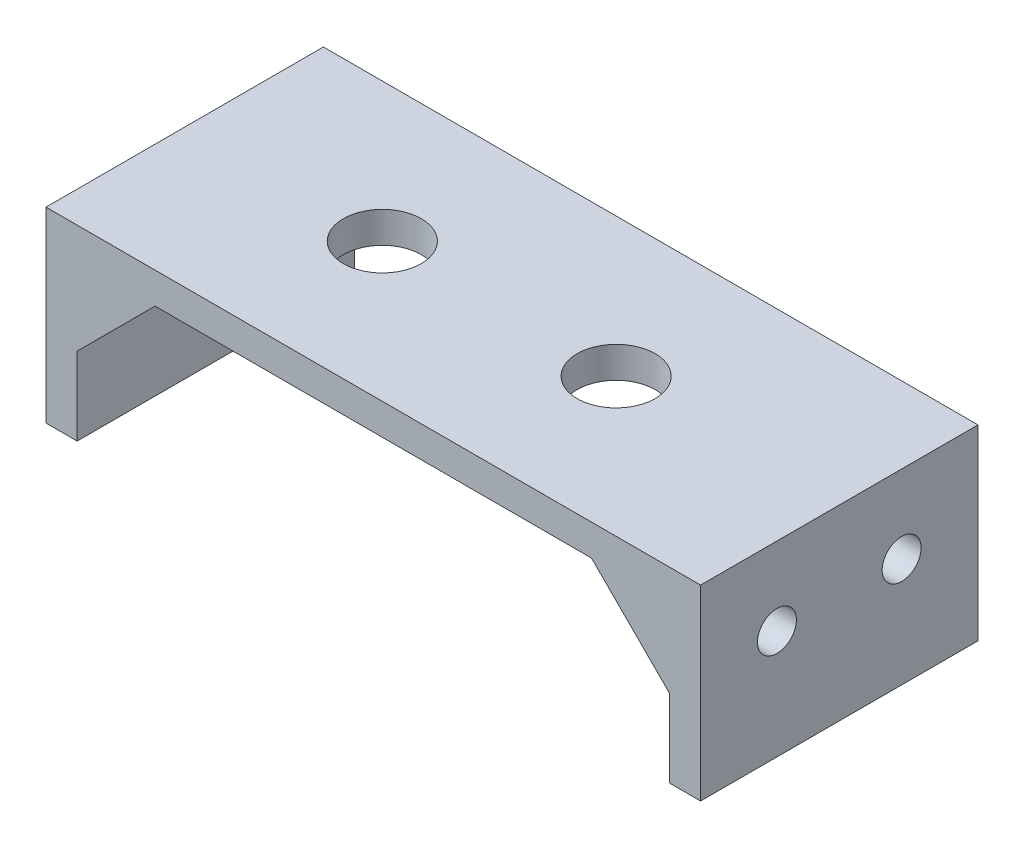
ISO-10303-21;
HEADER;
FILE_DESCRIPTION(('STEP AP214'),'2;1');
FILE_NAME('part.step','',(''),(''),'','','');
FILE_SCHEMA(('AUTOMOTIVE_DESIGN { 1 0 10303 214 1 1 1 1 }'));
ENDSEC;
DATA;
#1=APPLICATION_CONTEXT('core data for automotive mechanical design processes');
#2=APPLICATION_PROTOCOL_DEFINITION('international standard','automotive_design',2000,#1);
#3=PRODUCT_CONTEXT('',#1,'mechanical');
#4=PRODUCT('Part','Part','',(#3));
#5=PRODUCT_RELATED_PRODUCT_CATEGORY('part','',(#4));
#6=PRODUCT_DEFINITION_FORMATION('','',#4);
#7=PRODUCT_DEFINITION_CONTEXT('part definition',#1,'design');
#8=PRODUCT_DEFINITION('design','',#6,#7);
#9=PRODUCT_DEFINITION_SHAPE('','',#8);
#10=(LENGTH_UNIT() NAMED_UNIT(*) SI_UNIT(.MILLI.,.METRE.));
#11=(NAMED_UNIT(*) PLANE_ANGLE_UNIT() SI_UNIT($,.RADIAN.));
#12=(NAMED_UNIT(*) SI_UNIT($,.STERADIAN.) SOLID_ANGLE_UNIT());
#13=UNCERTAINTY_MEASURE_WITH_UNIT(LENGTH_MEASURE(1.E-05),#10,'distance_accuracy_value','');
#14=(GEOMETRIC_REPRESENTATION_CONTEXT(3) GLOBAL_UNCERTAINTY_ASSIGNED_CONTEXT((#13)) GLOBAL_UNIT_ASSIGNED_CONTEXT((#10,
#11,#12)) REPRESENTATION_CONTEXT('',''));
#15=CARTESIAN_POINT('',(0.,0.,0.));
#16=DIRECTION('',(0.,0.,1.));
#17=DIRECTION('',(1.,0.,0.));
#18=AXIS2_PLACEMENT_3D('',#15,#16,#17);
#19=CARTESIAN_POINT('',(0.,0.,0.));
#20=DIRECTION('',(0.,1.,0.));
#21=DIRECTION('',(0.,0.,1.));
#22=AXIS2_PLACEMENT_3D('',#19,#20,#21);
#23=PLANE('',#22);
#24=CARTESIAN_POINT('',(-8.31990662492034,0.,0.));
#25=DIRECTION('',(0.,-1.,0.));
#26=DIRECTION('',(0.,0.,-1.));
#27=AXIS2_PLACEMENT_3D('',#24,#25,#26);
#28=CIRCLE('',#27,2.5);
#29=CARTESIAN_POINT('',(-8.31990662492034,0.,-2.5));
#30=VERTEX_POINT('',#29);
#31=EDGE_CURVE('E454',#30,#30,#28,.T.);
#32=ORIENTED_EDGE('',*,*,#31,.F.);
#33=EDGE_LOOP('',(#32));
#34=FACE_BOUND('',#33,.T.);
#35=CARTESIAN_POINT('',(6.68009337507966,0.,0.));
#36=DIRECTION('',(0.,-1.,0.));
#37=DIRECTION('',(0.,0.,-1.));
#38=AXIS2_PLACEMENT_3D('',#35,#36,#37);
#39=CIRCLE('',#38,2.5);
#40=CARTESIAN_POINT('',(6.68009337507966,0.,-2.5));
#41=VERTEX_POINT('',#40);
#42=EDGE_CURVE('E185',#41,#41,#39,.T.);
#43=ORIENTED_EDGE('',*,*,#42,.F.);
#44=EDGE_LOOP('',(#43));
#45=FACE_BOUND('',#44,.T.);
#46=DIRECTION('',(0.,0.,-1.));
#47=VECTOR('',#46,1.);
#48=CARTESIAN_POINT('',(14.,0.,-6.9));
#49=LINE('',#48,#47);
#50=CARTESIAN_POINT('',(14.,0.,-6.9));
#51=VERTEX_POINT('',#50);
#52=CARTESIAN_POINT('',(14.,0.,-8.9));
#53=VERTEX_POINT('',#52);
#54=EDGE_CURVE('E173',#51,#53,#49,.T.);
#55=ORIENTED_EDGE('',*,*,#54,.F.);
#56=DIRECTION('',(-1.,0.,0.));
#57=VECTOR('',#56,1.);
#58=CARTESIAN_POINT('',(19.,0.,-6.9));
#59=LINE('',#58,#57);
#60=CARTESIAN_POINT('',(19.,0.,-6.9));
#61=VERTEX_POINT('',#60);
#62=EDGE_CURVE('E160',#61,#51,#59,.T.);
#63=ORIENTED_EDGE('',*,*,#62,.F.);
#64=DIRECTION('',(0.,0.,-1.));
#65=VECTOR('',#64,1.);
#66=CARTESIAN_POINT('',(19.,0.,8.90000000000001));
#67=LINE('',#66,#65);
#68=CARTESIAN_POINT('',(19.,0.,6.9));
#69=VERTEX_POINT('',#68);
#70=EDGE_CURVE('E178',#69,#61,#67,.T.);
#71=ORIENTED_EDGE('',*,*,#70,.F.);
#72=DIRECTION('',(-1.,0.,0.));
#73=VECTOR('',#72,1.);
#74=CARTESIAN_POINT('',(19.,0.,6.9));
#75=LINE('',#74,#73);
#76=CARTESIAN_POINT('',(14.,0.,6.9));
#77=VERTEX_POINT('',#76);
#78=EDGE_CURVE('E216',#69,#77,#75,.T.);
#79=ORIENTED_EDGE('',*,*,#78,.T.);
#80=DIRECTION('',(0.,0.,1.));
#81=VECTOR('',#80,1.);
#82=CARTESIAN_POINT('',(14.,0.,6.9));
#83=LINE('',#82,#81);
#84=CARTESIAN_POINT('',(14.,0.,8.9));
#85=VERTEX_POINT('',#84);
#86=EDGE_CURVE('E223',#77,#85,#83,.T.);
#87=ORIENTED_EDGE('',*,*,#86,.T.);
#88=DIRECTION('',(1.,0.,0.));
#89=VECTOR('',#88,1.);
#90=CARTESIAN_POINT('',(-21.,0.,8.9));
#91=LINE('',#90,#89);
#92=CARTESIAN_POINT('',(-14.,0.,8.9));
#93=VERTEX_POINT('',#92);
#94=EDGE_CURVE('E306',#93,#85,#91,.T.);
#95=ORIENTED_EDGE('',*,*,#94,.F.);
#96=DIRECTION('',(0.,0.,1.));
#97=VECTOR('',#96,1.);
#98=CARTESIAN_POINT('',(-14.,0.,6.9));
#99=LINE('',#98,#97);
#100=CARTESIAN_POINT('',(-14.,0.,6.9));
#101=VERTEX_POINT('',#100);
#102=EDGE_CURVE('E249',#101,#93,#99,.T.);
#103=ORIENTED_EDGE('',*,*,#102,.F.);
#104=DIRECTION('',(-1.,0.,0.));
#105=VECTOR('',#104,1.);
#106=CARTESIAN_POINT('',(-19.,0.,6.9));
#107=LINE('',#106,#105);
#108=CARTESIAN_POINT('',(-19.,0.,6.9));
#109=VERTEX_POINT('',#108);
#110=EDGE_CURVE('E241',#101,#109,#107,.T.);
#111=ORIENTED_EDGE('',*,*,#110,.T.);
#112=DIRECTION('',(0.,0.,1.));
#113=VECTOR('',#112,1.);
#114=CARTESIAN_POINT('',(-19.,0.,8.9));
#115=LINE('',#114,#113);
#116=CARTESIAN_POINT('',(-19.,0.,-6.9));
#117=VERTEX_POINT('',#116);
#118=EDGE_CURVE('E277',#117,#109,#115,.T.);
#119=ORIENTED_EDGE('',*,*,#118,.F.);
#120=DIRECTION('',(-1.,0.,0.));
#121=VECTOR('',#120,1.);
#122=CARTESIAN_POINT('',(-19.,0.,-6.9));
#123=LINE('',#122,#121);
#124=CARTESIAN_POINT('',(-14.,0.,-6.9));
#125=VERTEX_POINT('',#124);
#126=EDGE_CURVE('E55',#125,#117,#123,.T.);
#127=ORIENTED_EDGE('',*,*,#126,.F.);
#128=DIRECTION('',(0.,0.,-1.));
#129=VECTOR('',#128,1.);
#130=CARTESIAN_POINT('',(-14.,0.,-6.9));
#131=LINE('',#130,#129);
#132=CARTESIAN_POINT('',(-14.,0.,-8.9));
#133=VERTEX_POINT('',#132);
#134=EDGE_CURVE('E202',#125,#133,#131,.T.);
#135=ORIENTED_EDGE('',*,*,#134,.T.);
#136=DIRECTION('',(-1.,0.,0.));
#137=VECTOR('',#136,1.);
#138=CARTESIAN_POINT('',(-21.,0.,-8.9));
#139=LINE('',#138,#137);
#140=EDGE_CURVE('E63',#53,#133,#139,.T.);
#141=ORIENTED_EDGE('',*,*,#140,.F.);
#142=EDGE_LOOP('',(#55,#63,#71,#79,#87,#95,#103,#111,#119,#127,#135,#141));
#143=FACE_BOUND('',#142,.T.);
#144=ADVANCED_FACE('F39',(#34,#45,#143),#23,.F.);
#145=CARTESIAN_POINT('',(19.,-10.,8.90000000000001));
#146=DIRECTION('',(1.,0.,0.));
#147=DIRECTION('',(0.,0.,-1.));
#148=AXIS2_PLACEMENT_3D('',#145,#146,#147);
#149=PLANE('',#148);
#150=CARTESIAN_POINT('',(19.,-3.,4.));
#151=DIRECTION('',(1.,0.,0.));
#152=DIRECTION('',(0.,0.,-1.));
#153=AXIS2_PLACEMENT_3D('',#150,#151,#152);
#154=CIRCLE('',#153,1.25);
#155=CARTESIAN_POINT('',(19.,-3.,2.75));
#156=VERTEX_POINT('',#155);
#157=EDGE_CURVE('E424',#156,#156,#154,.T.);
#158=ORIENTED_EDGE('',*,*,#157,.T.);
#159=EDGE_LOOP('',(#158));
#160=FACE_BOUND('',#159,.T.);
#161=CARTESIAN_POINT('',(19.,-3.,-4.));
#162=DIRECTION('',(1.,0.,0.));
#163=DIRECTION('',(0.,0.,-1.));
#164=AXIS2_PLACEMENT_3D('',#161,#162,#163);
#165=CIRCLE('',#164,1.25);
#166=CARTESIAN_POINT('',(19.,-3.,-5.25));
#167=VERTEX_POINT('',#166);
#168=EDGE_CURVE('E425',#167,#167,#165,.T.);
#169=ORIENTED_EDGE('',*,*,#168,.T.);
#170=EDGE_LOOP('',(#169));
#171=FACE_BOUND('',#170,.T.);
#172=DIRECTION('',(0.,0.,-1.));
#173=VECTOR('',#172,1.);
#174=CARTESIAN_POINT('',(19.,-5.00000000000007,-6.9));
#175=LINE('',#174,#173);
#176=CARTESIAN_POINT('',(19.,-5.00000000000007,-6.9));
#177=VERTEX_POINT('',#176);
#178=CARTESIAN_POINT('',(19.,-5.00000000000007,-8.9));
#179=VERTEX_POINT('',#178);
#180=EDGE_CURVE('E166',#177,#179,#175,.T.);
#181=ORIENTED_EDGE('',*,*,#180,.T.);
#182=DIRECTION('',(0.,1.,0.));
#183=VECTOR('',#182,1.);
#184=CARTESIAN_POINT('',(19.,-10.,-8.9));
#185=LINE('',#184,#183);
#186=CARTESIAN_POINT('',(19.,-10.,-8.9));
#187=VERTEX_POINT('',#186);
#188=EDGE_CURVE('E269',#187,#179,#185,.T.);
#189=ORIENTED_EDGE('',*,*,#188,.F.);
#190=DIRECTION('',(0.,0.,-1.));
#191=VECTOR('',#190,1.);
#192=CARTESIAN_POINT('',(19.,-10.,8.90000000000001));
#193=LINE('',#192,#191);
#194=CARTESIAN_POINT('',(19.,-10.,8.90000000000001));
#195=VERTEX_POINT('',#194);
#196=EDGE_CURVE('E262',#195,#187,#193,.T.);
#197=ORIENTED_EDGE('',*,*,#196,.F.);
#198=DIRECTION('',(0.,1.,0.));
#199=VECTOR('',#198,1.);
#200=CARTESIAN_POINT('',(19.,-10.,8.90000000000001));
#201=LINE('',#200,#199);
#202=CARTESIAN_POINT('',(19.,-5.00000000000007,8.90000000000001));
#203=VERTEX_POINT('',#202);
#204=EDGE_CURVE('E274',#195,#203,#201,.T.);
#205=ORIENTED_EDGE('',*,*,#204,.T.);
#206=DIRECTION('',(0.,0.,1.));
#207=VECTOR('',#206,1.);
#208=CARTESIAN_POINT('',(19.,-5.00000000000007,6.9));
#209=LINE('',#208,#207);
#210=CARTESIAN_POINT('',(19.,-5.00000000000007,6.9));
#211=VERTEX_POINT('',#210);
#212=EDGE_CURVE('E227',#211,#203,#209,.T.);
#213=ORIENTED_EDGE('',*,*,#212,.F.);
#214=DIRECTION('',(0.,1.,0.));
#215=VECTOR('',#214,1.);
#216=CARTESIAN_POINT('',(19.,-5.00000000000007,6.9));
#217=LINE('',#216,#215);
#218=EDGE_CURVE('E213',#211,#69,#217,.T.);
#219=ORIENTED_EDGE('',*,*,#218,.T.);
#220=ORIENTED_EDGE('',*,*,#70,.T.);
#221=DIRECTION('',(0.,1.,0.));
#222=VECTOR('',#221,1.);
#223=CARTESIAN_POINT('',(19.,-5.00000000000007,-6.9));
#224=LINE('',#223,#222);
#225=EDGE_CURVE('E158',#177,#61,#224,.T.);
#226=ORIENTED_EDGE('',*,*,#225,.F.);
#227=EDGE_LOOP('',(#181,#189,#197,#205,#213,#219,#220,#226));
#228=FACE_BOUND('',#227,.T.);
#229=ADVANCED_FACE('F176',(#160,#171,#228),#149,.F.);
#230=CARTESIAN_POINT('',(-19.,-10.,8.9));
#231=DIRECTION('',(-1.,0.,0.));
#232=DIRECTION('',(0.,0.,1.));
#233=AXIS2_PLACEMENT_3D('',#230,#231,#232);
#234=PLANE('',#233);
#235=CARTESIAN_POINT('',(-19.,-3.,4.));
#236=DIRECTION('',(1.,0.,0.));
#237=DIRECTION('',(0.,0.,-1.));
#238=AXIS2_PLACEMENT_3D('',#235,#236,#237);
#239=CIRCLE('',#238,1.25);
#240=CARTESIAN_POINT('',(-19.,-3.,2.75));
#241=VERTEX_POINT('',#240);
#242=EDGE_CURVE('E439',#241,#241,#239,.T.);
#243=ORIENTED_EDGE('',*,*,#242,.F.);
#244=EDGE_LOOP('',(#243));
#245=FACE_BOUND('',#244,.T.);
#246=CARTESIAN_POINT('',(-19.,-3.,-4.));
#247=DIRECTION('',(1.,0.,0.));
#248=DIRECTION('',(0.,0.,-1.));
#249=AXIS2_PLACEMENT_3D('',#246,#247,#248);
#250=CIRCLE('',#249,1.25);
#251=CARTESIAN_POINT('',(-19.,-3.,-5.25));
#252=VERTEX_POINT('',#251);
#253=EDGE_CURVE('E447',#252,#252,#250,.T.);
#254=ORIENTED_EDGE('',*,*,#253,.F.);
#255=EDGE_LOOP('',(#254));
#256=FACE_BOUND('',#255,.T.);
#257=DIRECTION('',(0.,0.,-1.));
#258=VECTOR('',#257,1.);
#259=CARTESIAN_POINT('',(-19.,-5.,-6.9));
#260=LINE('',#259,#258);
#261=CARTESIAN_POINT('',(-19.,-5.,-6.9));
#262=VERTEX_POINT('',#261);
#263=CARTESIAN_POINT('',(-19.,-5.,-8.9));
#264=VERTEX_POINT('',#263);
#265=EDGE_CURVE('E206',#262,#264,#260,.T.);
#266=ORIENTED_EDGE('',*,*,#265,.F.);
#267=DIRECTION('',(0.,-1.,0.));
#268=VECTOR('',#267,1.);
#269=CARTESIAN_POINT('',(-19.,-5.,-6.9));
#270=LINE('',#269,#268);
#271=EDGE_CURVE('E193',#117,#262,#270,.T.);
#272=ORIENTED_EDGE('',*,*,#271,.F.);
#273=ORIENTED_EDGE('',*,*,#118,.T.);
#274=DIRECTION('',(0.,-1.,0.));
#275=VECTOR('',#274,1.);
#276=CARTESIAN_POINT('',(-19.,-5.,6.9));
#277=LINE('',#276,#275);
#278=CARTESIAN_POINT('',(-19.,-5.,6.9));
#279=VERTEX_POINT('',#278);
#280=EDGE_CURVE('E234',#109,#279,#277,.T.);
#281=ORIENTED_EDGE('',*,*,#280,.T.);
#282=DIRECTION('',(0.,0.,1.));
#283=VECTOR('',#282,1.);
#284=CARTESIAN_POINT('',(-19.,-5.,6.9));
#285=LINE('',#284,#283);
#286=CARTESIAN_POINT('',(-19.,-5.,8.9));
#287=VERTEX_POINT('',#286);
#288=EDGE_CURVE('E245',#279,#287,#285,.T.);
#289=ORIENTED_EDGE('',*,*,#288,.T.);
#290=DIRECTION('',(0.,1.,0.));
#291=VECTOR('',#290,1.);
#292=CARTESIAN_POINT('',(-19.,-10.,8.9));
#293=LINE('',#292,#291);
#294=CARTESIAN_POINT('',(-19.,-10.,8.9));
#295=VERTEX_POINT('',#294);
#296=EDGE_CURVE('E292',#295,#287,#293,.T.);
#297=ORIENTED_EDGE('',*,*,#296,.F.);
#298=DIRECTION('',(0.,0.,1.));
#299=VECTOR('',#298,1.);
#300=CARTESIAN_POINT('',(-19.,-10.,8.9));
#301=LINE('',#300,#299);
#302=CARTESIAN_POINT('',(-19.,-10.,-8.9));
#303=VERTEX_POINT('',#302);
#304=EDGE_CURVE('E285',#303,#295,#301,.T.);
#305=ORIENTED_EDGE('',*,*,#304,.F.);
#306=DIRECTION('',(0.,1.,0.));
#307=VECTOR('',#306,1.);
#308=CARTESIAN_POINT('',(-19.,-10.,-8.9));
#309=LINE('',#308,#307);
#310=EDGE_CURVE('E298',#303,#264,#309,.T.);
#311=ORIENTED_EDGE('',*,*,#310,.T.);
#312=EDGE_LOOP('',(#266,#272,#273,#281,#289,#297,#305,#311));
#313=FACE_BOUND('',#312,.T.);
#314=ADVANCED_FACE('F362',(#245,#256,#313),#234,.F.);
#315=CARTESIAN_POINT('',(21.,2.,-8.9));
#316=DIRECTION('',(-1.,0.,0.));
#317=DIRECTION('',(0.,0.,1.));
#318=AXIS2_PLACEMENT_3D('',#315,#316,#317);
#319=PLANE('',#318);
#320=CARTESIAN_POINT('',(21.,-3.,4.));
#321=DIRECTION('',(1.,0.,0.));
#322=DIRECTION('',(0.,0.,-1.));
#323=AXIS2_PLACEMENT_3D('',#320,#321,#322);
#324=CIRCLE('',#323,1.25);
#325=CARTESIAN_POINT('',(21.,-3.,2.75));
#326=VERTEX_POINT('',#325);
#327=EDGE_CURVE('E418',#326,#326,#324,.T.);
#328=ORIENTED_EDGE('',*,*,#327,.F.);
#329=EDGE_LOOP('',(#328));
#330=FACE_BOUND('',#329,.T.);
#331=CARTESIAN_POINT('',(21.,-3.,-4.));
#332=DIRECTION('',(1.,0.,0.));
#333=DIRECTION('',(0.,0.,-1.));
#334=AXIS2_PLACEMENT_3D('',#331,#332,#333);
#335=CIRCLE('',#334,1.25);
#336=CARTESIAN_POINT('',(21.,-3.,-5.25));
#337=VERTEX_POINT('',#336);
#338=EDGE_CURVE('E421',#337,#337,#335,.T.);
#339=ORIENTED_EDGE('',*,*,#338,.F.);
#340=EDGE_LOOP('',(#339));
#341=FACE_BOUND('',#340,.T.);
#342=DIRECTION('',(0.,-1.,0.));
#343=VECTOR('',#342,1.);
#344=CARTESIAN_POINT('',(21.,2.,8.9));
#345=LINE('',#344,#343);
#346=CARTESIAN_POINT('',(21.,2.,8.9));
#347=VERTEX_POINT('',#346);
#348=CARTESIAN_POINT('',(21.,-10.,8.9));
#349=VERTEX_POINT('',#348);
#350=EDGE_CURVE('E315',#347,#349,#345,.T.);
#351=ORIENTED_EDGE('',*,*,#350,.T.);
#352=DIRECTION('',(0.,0.,1.));
#353=VECTOR('',#352,1.);
#354=CARTESIAN_POINT('',(21.,-10.,8.9));
#355=LINE('',#354,#353);
#356=CARTESIAN_POINT('',(21.,-10.,-8.9));
#357=VERTEX_POINT('',#356);
#358=EDGE_CURVE('E255',#357,#349,#355,.T.);
#359=ORIENTED_EDGE('',*,*,#358,.F.);
#360=DIRECTION('',(0.,-1.,0.));
#361=VECTOR('',#360,1.);
#362=CARTESIAN_POINT('',(21.,2.,-8.9));
#363=LINE('',#362,#361);
#364=CARTESIAN_POINT('',(21.,2.,-8.9));
#365=VERTEX_POINT('',#364);
#366=EDGE_CURVE('E11',#365,#357,#363,.T.);
#367=ORIENTED_EDGE('',*,*,#366,.F.);
#368=DIRECTION('',(0.,0.,-1.));
#369=VECTOR('',#368,1.);
#370=CARTESIAN_POINT('',(21.,2.,-8.9));
#371=LINE('',#370,#369);
#372=EDGE_CURVE('E301',#347,#365,#371,.T.);
#373=ORIENTED_EDGE('',*,*,#372,.F.);
#374=EDGE_LOOP('',(#351,#359,#367,#373));
#375=FACE_BOUND('',#374,.T.);
#376=ADVANCED_FACE('F41',(#330,#341,#375),#319,.F.);
#377=CARTESIAN_POINT('',(-21.,2.,-8.9));
#378=DIRECTION('',(0.,0.,1.));
#379=DIRECTION('',(1.,0.,0.));
#380=AXIS2_PLACEMENT_3D('',#377,#378,#379);
#381=PLANE('',#380);
#382=DIRECTION('',(0.707106781186545,-0.70710678118655,0.));
#383=VECTOR('',#382,1.);
#384=CARTESIAN_POINT('',(19.,-5.00000000000007,-8.9));
#385=LINE('',#384,#383);
#386=EDGE_CURVE('E168',#53,#179,#385,.T.);
#387=ORIENTED_EDGE('',*,*,#386,.F.);
#388=ORIENTED_EDGE('',*,*,#140,.T.);
#389=DIRECTION('',(0.707106781186548,0.707106781186547,0.));
#390=VECTOR('',#389,1.);
#391=CARTESIAN_POINT('',(-19.,-5.,-8.9));
#392=LINE('',#391,#390);
#393=EDGE_CURVE('E191',#264,#133,#392,.T.);
#394=ORIENTED_EDGE('',*,*,#393,.F.);
#395=ORIENTED_EDGE('',*,*,#310,.F.);
#396=DIRECTION('',(1.,0.,0.));
#397=VECTOR('',#396,1.);
#398=CARTESIAN_POINT('',(-21.,-10.,-8.9));
#399=LINE('',#398,#397);
#400=CARTESIAN_POINT('',(-21.,-10.,-8.9));
#401=VERTEX_POINT('',#400);
#402=EDGE_CURVE('E282',#401,#303,#399,.T.);
#403=ORIENTED_EDGE('',*,*,#402,.F.);
#404=DIRECTION('',(0.,-1.,0.));
#405=VECTOR('',#404,1.);
#406=CARTESIAN_POINT('',(-21.,2.,-8.9));
#407=LINE('',#406,#405);
#408=CARTESIAN_POINT('',(-21.,2.,-8.9));
#409=VERTEX_POINT('',#408);
#410=EDGE_CURVE('E48',#409,#401,#407,.T.);
#411=ORIENTED_EDGE('',*,*,#410,.F.);
#412=DIRECTION('',(-1.,0.,0.));
#413=VECTOR('',#412,1.);
#414=CARTESIAN_POINT('',(-21.,2.,-8.9));
#415=LINE('',#414,#413);
#416=EDGE_CURVE('E305',#365,#409,#415,.T.);
#417=ORIENTED_EDGE('',*,*,#416,.F.);
#418=ORIENTED_EDGE('',*,*,#366,.T.);
#419=DIRECTION('',(1.,0.,0.));
#420=VECTOR('',#419,1.);
#421=CARTESIAN_POINT('',(21.,-10.,-8.9));
#422=LINE('',#421,#420);
#423=EDGE_CURVE('E265',#187,#357,#422,.T.);
#424=ORIENTED_EDGE('',*,*,#423,.F.);
#425=ORIENTED_EDGE('',*,*,#188,.T.);
#426=EDGE_LOOP('',(#387,#388,#394,#395,#403,#411,#417,#418,#424,#425));
#427=FACE_BOUND('',#426,.T.);
#428=ADVANCED_FACE('F334',(#427),#381,.F.);
#429=CARTESIAN_POINT('',(-21.,2.,-8.9));
#430=DIRECTION('',(1.,0.,0.));
#431=DIRECTION('',(0.,0.,-1.));
#432=AXIS2_PLACEMENT_3D('',#429,#430,#431);
#433=PLANE('',#432);
#434=CARTESIAN_POINT('',(-21.,-3.,4.));
#435=DIRECTION('',(1.,0.,0.));
#436=DIRECTION('',(0.,0.,-1.));
#437=AXIS2_PLACEMENT_3D('',#434,#435,#436);
#438=CIRCLE('',#437,1.25);
#439=CARTESIAN_POINT('',(-21.,-3.,2.75));
#440=VERTEX_POINT('',#439);
#441=EDGE_CURVE('E435',#440,#440,#438,.T.);
#442=ORIENTED_EDGE('',*,*,#441,.T.);
#443=EDGE_LOOP('',(#442));
#444=FACE_BOUND('',#443,.T.);
#445=CARTESIAN_POINT('',(-21.,-3.,-4.));
#446=DIRECTION('',(1.,0.,0.));
#447=DIRECTION('',(0.,0.,-1.));
#448=AXIS2_PLACEMENT_3D('',#445,#446,#447);
#449=CIRCLE('',#448,1.25);
#450=CARTESIAN_POINT('',(-21.,-3.,-5.25));
#451=VERTEX_POINT('',#450);
#452=EDGE_CURVE('E443',#451,#451,#449,.T.);
#453=ORIENTED_EDGE('',*,*,#452,.T.);
#454=EDGE_LOOP('',(#453));
#455=FACE_BOUND('',#454,.T.);
#456=ORIENTED_EDGE('',*,*,#410,.T.);
#457=DIRECTION('',(0.,0.,-1.));
#458=VECTOR('',#457,1.);
#459=CARTESIAN_POINT('',(-21.,-10.,8.9));
#460=LINE('',#459,#458);
#461=CARTESIAN_POINT('',(-21.,-10.,8.9));
#462=VERTEX_POINT('',#461);
#463=EDGE_CURVE('E278',#462,#401,#460,.T.);
#464=ORIENTED_EDGE('',*,*,#463,.F.);
#465=DIRECTION('',(0.,-1.,0.));
#466=VECTOR('',#465,1.);
#467=CARTESIAN_POINT('',(-21.,2.,8.9));
#468=LINE('',#467,#466);
#469=CARTESIAN_POINT('',(-21.,2.,8.9));
#470=VERTEX_POINT('',#469);
#471=EDGE_CURVE('E323',#470,#462,#468,.T.);
#472=ORIENTED_EDGE('',*,*,#471,.F.);
#473=DIRECTION('',(0.,0.,1.));
#474=VECTOR('',#473,1.);
#475=CARTESIAN_POINT('',(-21.,2.,-8.9));
#476=LINE('',#475,#474);
#477=EDGE_CURVE('E309',#409,#470,#476,.T.);
#478=ORIENTED_EDGE('',*,*,#477,.F.);
#479=EDGE_LOOP('',(#456,#464,#472,#478));
#480=FACE_BOUND('',#479,.T.);
#481=ADVANCED_FACE('F331',(#444,#455,#480),#433,.F.);
#482=CARTESIAN_POINT('',(-21.,2.,8.9));
#483=DIRECTION('',(0.,0.,-1.));
#484=DIRECTION('',(-1.,0.,0.));
#485=AXIS2_PLACEMENT_3D('',#482,#483,#484);
#486=PLANE('',#485);
#487=ORIENTED_EDGE('',*,*,#94,.T.);
#488=DIRECTION('',(0.707106781186545,-0.70710678118655,0.));
#489=VECTOR('',#488,1.);
#490=CARTESIAN_POINT('',(19.,-5.00000000000007,8.9));
#491=LINE('',#490,#489);
#492=EDGE_CURVE('E210',#85,#203,#491,.T.);
#493=ORIENTED_EDGE('',*,*,#492,.T.);
#494=ORIENTED_EDGE('',*,*,#204,.F.);
#495=DIRECTION('',(-1.,0.,0.));
#496=VECTOR('',#495,1.);
#497=CARTESIAN_POINT('',(21.,-10.,8.9));
#498=LINE('',#497,#496);
#499=EDGE_CURVE('E259',#349,#195,#498,.T.);
#500=ORIENTED_EDGE('',*,*,#499,.F.);
#501=ORIENTED_EDGE('',*,*,#350,.F.);
#502=DIRECTION('',(1.,0.,0.));
#503=VECTOR('',#502,1.);
#504=CARTESIAN_POINT('',(-21.,2.,8.9));
#505=LINE('',#504,#503);
#506=EDGE_CURVE('E312',#470,#347,#505,.T.);
#507=ORIENTED_EDGE('',*,*,#506,.F.);
#508=ORIENTED_EDGE('',*,*,#471,.T.);
#509=DIRECTION('',(-1.,0.,0.));
#510=VECTOR('',#509,1.);
#511=CARTESIAN_POINT('',(-21.,-10.,8.9));
#512=LINE('',#511,#510);
#513=EDGE_CURVE('E288',#295,#462,#512,.T.);
#514=ORIENTED_EDGE('',*,*,#513,.F.);
#515=ORIENTED_EDGE('',*,*,#296,.T.);
#516=DIRECTION('',(0.707106781186548,0.707106781186547,0.));
#517=VECTOR('',#516,1.);
#518=CARTESIAN_POINT('',(-19.,-5.,8.9));
#519=LINE('',#518,#517);
#520=EDGE_CURVE('E231',#287,#93,#519,.T.);
#521=ORIENTED_EDGE('',*,*,#520,.T.);
#522=EDGE_LOOP('',(#487,#493,#494,#500,#501,#507,#508,#514,#515,#521));
#523=FACE_BOUND('',#522,.T.);
#524=ADVANCED_FACE('F341',(#523),#486,.F.);
#525=CARTESIAN_POINT('',(0.,2.,0.));
#526=DIRECTION('',(0.,1.,0.));
#527=DIRECTION('',(0.,0.,1.));
#528=AXIS2_PLACEMENT_3D('',#525,#526,#527);
#529=PLANE('',#528);
#530=CARTESIAN_POINT('',(-8.31990662492034,2.,0.));
#531=DIRECTION('',(0.,-1.,0.));
#532=DIRECTION('',(0.,0.,-1.));
#533=AXIS2_PLACEMENT_3D('',#530,#531,#532);
#534=CIRCLE('',#533,2.5);
#535=CARTESIAN_POINT('',(-8.31990662492034,2.,-2.5));
#536=VERTEX_POINT('',#535);
#537=EDGE_CURVE('E182',#536,#536,#534,.T.);
#538=ORIENTED_EDGE('',*,*,#537,.T.);
#539=EDGE_LOOP('',(#538));
#540=FACE_BOUND('',#539,.T.);
#541=CARTESIAN_POINT('',(6.68009337507966,2.,0.));
#542=DIRECTION('',(0.,-1.,0.));
#543=DIRECTION('',(0.,0.,-1.));
#544=AXIS2_PLACEMENT_3D('',#541,#542,#543);
#545=CIRCLE('',#544,2.5);
#546=CARTESIAN_POINT('',(6.68009337507966,2.,-2.5));
#547=VERTEX_POINT('',#546);
#548=EDGE_CURVE('E457',#547,#547,#545,.T.);
#549=ORIENTED_EDGE('',*,*,#548,.T.);
#550=EDGE_LOOP('',(#549));
#551=FACE_BOUND('',#550,.T.);
#552=ORIENTED_EDGE('',*,*,#372,.T.);
#553=ORIENTED_EDGE('',*,*,#416,.T.);
#554=ORIENTED_EDGE('',*,*,#477,.T.);
#555=ORIENTED_EDGE('',*,*,#506,.T.);
#556=EDGE_LOOP('',(#552,#553,#554,#555));
#557=FACE_BOUND('',#556,.T.);
#558=ADVANCED_FACE('F347',(#540,#551,#557),#529,.T.);
#559=CARTESIAN_POINT('',(0.,-10.,0.));
#560=DIRECTION('',(0.,-1.,0.));
#561=DIRECTION('',(0.,0.,-1.));
#562=AXIS2_PLACEMENT_3D('',#559,#560,#561);
#563=PLANE('',#562);
#564=ORIENTED_EDGE('',*,*,#463,.T.);
#565=ORIENTED_EDGE('',*,*,#402,.T.);
#566=ORIENTED_EDGE('',*,*,#304,.T.);
#567=ORIENTED_EDGE('',*,*,#513,.T.);
#568=EDGE_LOOP('',(#564,#565,#566,#567));
#569=FACE_BOUND('',#568,.T.);
#570=ADVANCED_FACE('F337',(#569),#563,.T.);
#571=CARTESIAN_POINT('',(0.,-10.,0.));
#572=DIRECTION('',(0.,1.,0.));
#573=DIRECTION('',(0.,0.,1.));
#574=AXIS2_PLACEMENT_3D('',#571,#572,#573);
#575=PLANE('',#574);
#576=ORIENTED_EDGE('',*,*,#358,.T.);
#577=ORIENTED_EDGE('',*,*,#499,.T.);
#578=ORIENTED_EDGE('',*,*,#196,.T.);
#579=ORIENTED_EDGE('',*,*,#423,.T.);
#580=EDGE_LOOP('',(#576,#577,#578,#579));
#581=FACE_BOUND('',#580,.T.);
#582=ADVANCED_FACE('F353',(#581),#575,.F.);
#583=CARTESIAN_POINT('',(-19.,-5.,6.9));
#584=DIRECTION('',(0.707106781186547,-0.707106781186548,0.));
#585=DIRECTION('',(0.707106781186548,0.707106781186547,0.));
#586=AXIS2_PLACEMENT_3D('',#583,#584,#585);
#587=PLANE('',#586);
#588=ORIENTED_EDGE('',*,*,#520,.F.);
#589=ORIENTED_EDGE('',*,*,#288,.F.);
#590=DIRECTION('',(0.707106781186548,0.707106781186547,0.));
#591=VECTOR('',#590,1.);
#592=CARTESIAN_POINT('',(-19.,-5.,6.9));
#593=LINE('',#592,#591);
#594=EDGE_CURVE('E238',#279,#101,#593,.T.);
#595=ORIENTED_EDGE('',*,*,#594,.T.);
#596=ORIENTED_EDGE('',*,*,#102,.T.);
#597=EDGE_LOOP('',(#588,#589,#595,#596));
#598=FACE_BOUND('',#597,.T.);
#599=ADVANCED_FACE('F366',(#598),#587,.T.);
#600=CARTESIAN_POINT('',(0.,0.,6.9));
#601=DIRECTION('',(0.,0.,-1.));
#602=DIRECTION('',(-1.,0.,0.));
#603=AXIS2_PLACEMENT_3D('',#600,#601,#602);
#604=PLANE('',#603);
#605=ORIENTED_EDGE('',*,*,#280,.F.);
#606=ORIENTED_EDGE('',*,*,#110,.F.);
#607=ORIENTED_EDGE('',*,*,#594,.F.);
#608=EDGE_LOOP('',(#605,#606,#607));
#609=FACE_BOUND('',#608,.T.);
#610=ADVANCED_FACE('F369',(#609),#604,.T.);
#611=CARTESIAN_POINT('',(19.,-5.00000000000007,6.9));
#612=DIRECTION('',(-0.70710678118655,-0.707106781186545,0.));
#613=DIRECTION('',(0.707106781186545,-0.70710678118655,0.));
#614=AXIS2_PLACEMENT_3D('',#611,#612,#613);
#615=PLANE('',#614);
#616=ORIENTED_EDGE('',*,*,#492,.F.);
#617=ORIENTED_EDGE('',*,*,#86,.F.);
#618=DIRECTION('',(0.707106781186545,-0.70710678118655,0.));
#619=VECTOR('',#618,1.);
#620=CARTESIAN_POINT('',(19.,-5.00000000000007,6.9));
#621=LINE('',#620,#619);
#622=EDGE_CURVE('E219',#77,#211,#621,.T.);
#623=ORIENTED_EDGE('',*,*,#622,.T.);
#624=ORIENTED_EDGE('',*,*,#212,.T.);
#625=EDGE_LOOP('',(#616,#617,#623,#624));
#626=FACE_BOUND('',#625,.T.);
#627=ADVANCED_FACE('F374',(#626),#615,.T.);
#628=CARTESIAN_POINT('',(0.,0.,6.9));
#629=DIRECTION('',(0.,0.,1.));
#630=DIRECTION('',(1.,0.,0.));
#631=AXIS2_PLACEMENT_3D('',#628,#629,#630);
#632=PLANE('',#631);
#633=ORIENTED_EDGE('',*,*,#218,.F.);
#634=ORIENTED_EDGE('',*,*,#622,.F.);
#635=ORIENTED_EDGE('',*,*,#78,.F.);
#636=EDGE_LOOP('',(#633,#634,#635));
#637=FACE_BOUND('',#636,.T.);
#638=ADVANCED_FACE('F379',(#637),#632,.F.);
#639=CARTESIAN_POINT('',(-19.,-5.,-6.9));
#640=DIRECTION('',(-0.707106781186547,0.707106781186548,0.));
#641=DIRECTION('',(-0.707106781186548,-0.707106781186547,0.));
#642=AXIS2_PLACEMENT_3D('',#639,#640,#641);
#643=PLANE('',#642);
#644=ORIENTED_EDGE('',*,*,#393,.T.);
#645=ORIENTED_EDGE('',*,*,#134,.F.);
#646=DIRECTION('',(0.707106781186548,0.707106781186547,0.));
#647=VECTOR('',#646,1.);
#648=CARTESIAN_POINT('',(-19.,-5.,-6.9));
#649=LINE('',#648,#647);
#650=EDGE_CURVE('E199',#262,#125,#649,.T.);
#651=ORIENTED_EDGE('',*,*,#650,.F.);
#652=ORIENTED_EDGE('',*,*,#265,.T.);
#653=EDGE_LOOP('',(#644,#645,#651,#652));
#654=FACE_BOUND('',#653,.T.);
#655=ADVANCED_FACE('F360',(#654),#643,.F.);
#656=CARTESIAN_POINT('',(0.,0.,-6.9));
#657=DIRECTION('',(0.,0.,1.));
#658=DIRECTION('',(-1.,0.,0.));
#659=AXIS2_PLACEMENT_3D('',#656,#657,#658);
#660=PLANE('',#659);
#661=ORIENTED_EDGE('',*,*,#271,.T.);
#662=ORIENTED_EDGE('',*,*,#650,.T.);
#663=ORIENTED_EDGE('',*,*,#126,.T.);
#664=EDGE_LOOP('',(#661,#662,#663));
#665=FACE_BOUND('',#664,.T.);
#666=ADVANCED_FACE('F386',(#665),#660,.T.);
#667=CARTESIAN_POINT('',(19.,-5.00000000000007,-6.9));
#668=DIRECTION('',(0.70710678118655,0.707106781186545,0.));
#669=DIRECTION('',(-0.707106781186545,0.70710678118655,0.));
#670=AXIS2_PLACEMENT_3D('',#667,#668,#669);
#671=PLANE('',#670);
#672=ORIENTED_EDGE('',*,*,#386,.T.);
#673=ORIENTED_EDGE('',*,*,#180,.F.);
#674=DIRECTION('',(0.707106781186545,-0.70710678118655,0.));
#675=VECTOR('',#674,1.);
#676=CARTESIAN_POINT('',(19.,-5.00000000000007,-6.9));
#677=LINE('',#676,#675);
#678=EDGE_CURVE('E154',#51,#177,#677,.T.);
#679=ORIENTED_EDGE('',*,*,#678,.F.);
#680=ORIENTED_EDGE('',*,*,#54,.T.);
#681=EDGE_LOOP('',(#672,#673,#679,#680));
#682=FACE_BOUND('',#681,.T.);
#683=ADVANCED_FACE('F167',(#682),#671,.F.);
#684=CARTESIAN_POINT('',(0.,0.,-6.9));
#685=DIRECTION('',(0.,0.,-1.));
#686=DIRECTION('',(1.,0.,0.));
#687=AXIS2_PLACEMENT_3D('',#684,#685,#686);
#688=PLANE('',#687);
#689=ORIENTED_EDGE('',*,*,#225,.T.);
#690=ORIENTED_EDGE('',*,*,#62,.T.);
#691=ORIENTED_EDGE('',*,*,#678,.T.);
#692=EDGE_LOOP('',(#689,#690,#691));
#693=FACE_BOUND('',#692,.T.);
#694=ADVANCED_FACE('F156',(#693),#688,.F.);
#695=CARTESIAN_POINT('',(6.68009337507966,2.,0.));
#696=DIRECTION('',(0.,-1.,0.));
#697=DIRECTION('',(0.,0.,-1.));
#698=AXIS2_PLACEMENT_3D('',#695,#696,#697);
#699=CYLINDRICAL_SURFACE('',#698,2.5);
#700=ORIENTED_EDGE('',*,*,#548,.F.);
#701=EDGE_LOOP('',(#700));
#702=FACE_BOUND('',#701,.T.);
#703=ORIENTED_EDGE('',*,*,#42,.T.);
#704=EDGE_LOOP('',(#703));
#705=FACE_BOUND('',#704,.T.);
#706=ADVANCED_FACE('F466',(#702,#705),#699,.F.);
#707=CARTESIAN_POINT('',(-8.31990662492034,2.,0.));
#708=DIRECTION('',(0.,-1.,0.));
#709=DIRECTION('',(0.,0.,-1.));
#710=AXIS2_PLACEMENT_3D('',#707,#708,#709);
#711=CYLINDRICAL_SURFACE('',#710,2.5);
#712=ORIENTED_EDGE('',*,*,#537,.F.);
#713=EDGE_LOOP('',(#712));
#714=FACE_BOUND('',#713,.T.);
#715=ORIENTED_EDGE('',*,*,#31,.T.);
#716=EDGE_LOOP('',(#715));
#717=FACE_BOUND('',#716,.T.);
#718=ADVANCED_FACE('F468',(#714,#717),#711,.F.);
#719=CARTESIAN_POINT('',(-21.,-3.,-4.));
#720=DIRECTION('',(1.,0.,0.));
#721=DIRECTION('',(0.,0.,-1.));
#722=AXIS2_PLACEMENT_3D('',#719,#720,#721);
#723=CYLINDRICAL_SURFACE('',#722,1.25);
#724=ORIENTED_EDGE('',*,*,#452,.F.);
#725=EDGE_LOOP('',(#724));
#726=FACE_BOUND('',#725,.T.);
#727=ORIENTED_EDGE('',*,*,#253,.T.);
#728=EDGE_LOOP('',(#727));
#729=FACE_BOUND('',#728,.T.);
#730=ADVANCED_FACE('F475',(#726,#729),#723,.F.);
#731=CARTESIAN_POINT('',(-21.,-3.,4.));
#732=DIRECTION('',(1.,0.,0.));
#733=DIRECTION('',(0.,0.,-1.));
#734=AXIS2_PLACEMENT_3D('',#731,#732,#733);
#735=CYLINDRICAL_SURFACE('',#734,1.25);
#736=ORIENTED_EDGE('',*,*,#441,.F.);
#737=EDGE_LOOP('',(#736));
#738=FACE_BOUND('',#737,.T.);
#739=ORIENTED_EDGE('',*,*,#242,.T.);
#740=EDGE_LOOP('',(#739));
#741=FACE_BOUND('',#740,.T.);
#742=ADVANCED_FACE('F549',(#738,#741),#735,.F.);
#743=CARTESIAN_POINT('',(21.,-3.,-4.));
#744=DIRECTION('',(-1.,0.,0.));
#745=DIRECTION('',(0.,0.,1.));
#746=AXIS2_PLACEMENT_3D('',#743,#744,#745);
#747=CYLINDRICAL_SURFACE('',#746,1.25);
#748=ORIENTED_EDGE('',*,*,#338,.T.);
#749=EDGE_LOOP('',(#748));
#750=FACE_BOUND('',#749,.T.);
#751=ORIENTED_EDGE('',*,*,#168,.F.);
#752=EDGE_LOOP('',(#751));
#753=FACE_BOUND('',#752,.T.);
#754=ADVANCED_FACE('F558',(#750,#753),#747,.F.);
#755=CARTESIAN_POINT('',(21.,-3.,4.));
#756=DIRECTION('',(-1.,0.,0.));
#757=DIRECTION('',(0.,0.,1.));
#758=AXIS2_PLACEMENT_3D('',#755,#756,#757);
#759=CYLINDRICAL_SURFACE('',#758,1.25);
#760=ORIENTED_EDGE('',*,*,#327,.T.);
#761=EDGE_LOOP('',(#760));
#762=FACE_BOUND('',#761,.T.);
#763=ORIENTED_EDGE('',*,*,#157,.F.);
#764=EDGE_LOOP('',(#763));
#765=FACE_BOUND('',#764,.T.);
#766=ADVANCED_FACE('F578',(#762,#765),#759,.F.);
#767=CLOSED_SHELL('',(#144,#229,#314,#376,#428,#481,#524,#558,#570,#582,#599,#610,#627,#638,
#655,#666,#683,#694,#706,#718,#730,#742,#754,#766));
#768=MANIFOLD_SOLID_BREP('B2',#767);
#769=ADVANCED_BREP_SHAPE_REPRESENTATION('',(#18,#768),#14);
#770=SHAPE_DEFINITION_REPRESENTATION(#9,#769);
ENDSEC;
END-ISO-10303-21;
